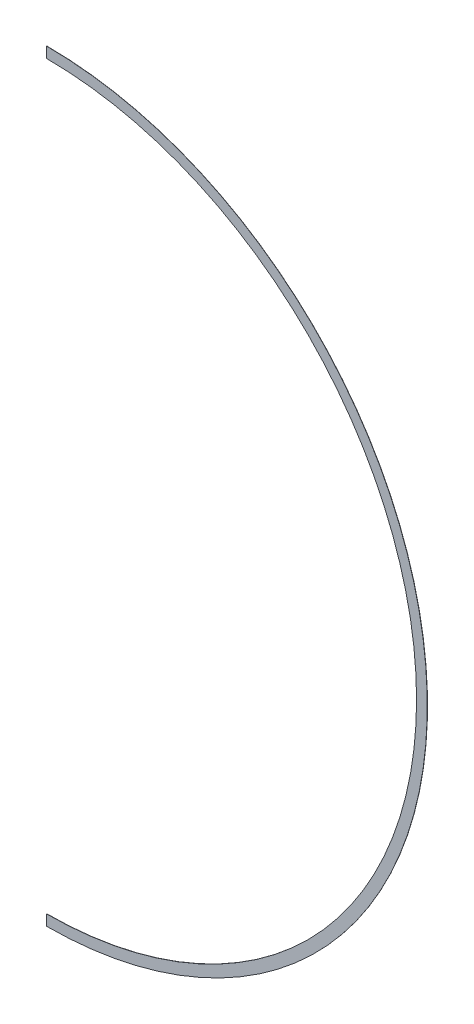
ISO-10303-21;
HEADER;
FILE_DESCRIPTION(('STEP AP214'),'2;1');
FILE_NAME('part.step','',(''),(''),'','','');
FILE_SCHEMA(('AUTOMOTIVE_DESIGN { 1 0 10303 214 1 1 1 1 }'));
ENDSEC;
DATA;
#1=APPLICATION_CONTEXT('core data for automotive mechanical design processes');
#2=APPLICATION_PROTOCOL_DEFINITION('international standard','automotive_design',2000,#1);
#3=PRODUCT_CONTEXT('',#1,'mechanical');
#4=PRODUCT('Part','Part','',(#3));
#5=PRODUCT_RELATED_PRODUCT_CATEGORY('part','',(#4));
#6=PRODUCT_DEFINITION_FORMATION('','',#4);
#7=PRODUCT_DEFINITION_CONTEXT('part definition',#1,'design');
#8=PRODUCT_DEFINITION('design','',#6,#7);
#9=PRODUCT_DEFINITION_SHAPE('','',#8);
#10=(LENGTH_UNIT() NAMED_UNIT(*) SI_UNIT(.MILLI.,.METRE.));
#11=(NAMED_UNIT(*) PLANE_ANGLE_UNIT() SI_UNIT($,.RADIAN.));
#12=(NAMED_UNIT(*) SI_UNIT($,.STERADIAN.) SOLID_ANGLE_UNIT());
#13=UNCERTAINTY_MEASURE_WITH_UNIT(LENGTH_MEASURE(1.E-05),#10,'distance_accuracy_value','');
#14=(GEOMETRIC_REPRESENTATION_CONTEXT(3) GLOBAL_UNCERTAINTY_ASSIGNED_CONTEXT((#13)) GLOBAL_UNIT_ASSIGNED_CONTEXT((#10,
#11,#12)) REPRESENTATION_CONTEXT('',''));
#15=CARTESIAN_POINT('',(0.,0.,0.));
#16=DIRECTION('',(0.,0.,1.));
#17=DIRECTION('',(1.,0.,0.));
#18=AXIS2_PLACEMENT_3D('',#15,#16,#17);
#19=CARTESIAN_POINT('',(0.,0.,0.127));
#20=DIRECTION('',(0.,0.,-1.));
#21=DIRECTION('',(-1.,0.,0.));
#22=AXIS2_PLACEMENT_3D('',#19,#20,#21);
#23=CYLINDRICAL_SURFACE('',#22,207.);
#24=CARTESIAN_POINT('',(0.,0.,0.));
#25=DIRECTION('',(0.,0.,-1.));
#26=DIRECTION('',(-1.,0.,0.));
#27=AXIS2_PLACEMENT_3D('',#24,#25,#26);
#28=CIRCLE('',#27,207.);
#29=CARTESIAN_POINT('',(0.249999999999988,206.999849033761,0.));
#30=VERTEX_POINT('',#29);
#31=CARTESIAN_POINT('',(0.250000000000038,-206.999849033761,0.));
#32=VERTEX_POINT('',#31);
#33=EDGE_CURVE('E98',#30,#32,#28,.T.);
#34=ORIENTED_EDGE('',*,*,#33,.T.);
#35=DIRECTION('',(0.,0.,-1.));
#36=VECTOR('',#35,1.);
#37=CARTESIAN_POINT('',(0.250000000000038,-206.999849033761,0.127));
#38=LINE('',#37,#36);
#39=CARTESIAN_POINT('',(0.250000000000038,-206.999849033761,0.127));
#40=VERTEX_POINT('',#39);
#41=EDGE_CURVE('E56',#32,#40,#38,.F.);
#42=ORIENTED_EDGE('',*,*,#41,.T.);
#43=CARTESIAN_POINT('',(0.,0.,0.127));
#44=DIRECTION('',(0.,0.,-1.));
#45=DIRECTION('',(-1.,0.,0.));
#46=AXIS2_PLACEMENT_3D('',#43,#44,#45);
#47=CIRCLE('',#46,207.);
#48=CARTESIAN_POINT('',(0.249999999999988,206.999849033761,0.127));
#49=VERTEX_POINT('',#48);
#50=EDGE_CURVE('E89',#49,#40,#47,.T.);
#51=ORIENTED_EDGE('',*,*,#50,.F.);
#52=DIRECTION('',(0.,0.,-1.));
#53=VECTOR('',#52,1.);
#54=CARTESIAN_POINT('',(0.249999999999988,206.999849033761,0.127));
#55=LINE('',#54,#53);
#56=EDGE_CURVE('E80',#49,#30,#55,.T.);
#57=ORIENTED_EDGE('',*,*,#56,.T.);
#58=EDGE_LOOP('',(#34,#42,#51,#57));
#59=FACE_BOUND('',#58,.T.);
#60=ADVANCED_FACE('F35',(#59),#23,.F.);
#61=CARTESIAN_POINT('',(0.,0.,0.127));
#62=DIRECTION('',(0.,0.,-1.));
#63=DIRECTION('',(-1.,0.,0.));
#64=AXIS2_PLACEMENT_3D('',#61,#62,#63);
#65=CYLINDRICAL_SURFACE('',#64,213.);
#66=CARTESIAN_POINT('',(0.,0.,0.127));
#67=DIRECTION('',(0.,0.,1.));
#68=DIRECTION('',(-1.,0.,0.));
#69=AXIS2_PLACEMENT_3D('',#66,#67,#68);
#70=CIRCLE('',#69,213.);
#71=CARTESIAN_POINT('',(0.250000000000039,-212.999853286334,0.127));
#72=VERTEX_POINT('',#71);
#73=CARTESIAN_POINT('',(0.249999999999987,212.999853286334,0.127));
#74=VERTEX_POINT('',#73);
#75=EDGE_CURVE('E87',#72,#74,#70,.T.);
#76=ORIENTED_EDGE('',*,*,#75,.F.);
#77=DIRECTION('',(0.,0.,-1.));
#78=VECTOR('',#77,1.);
#79=CARTESIAN_POINT('',(0.250000000000039,-212.999853286334,0.127));
#80=LINE('',#79,#78);
#81=CARTESIAN_POINT('',(0.250000000000039,-212.999853286334,0.));
#82=VERTEX_POINT('',#81);
#83=EDGE_CURVE('E72',#72,#82,#80,.T.);
#84=ORIENTED_EDGE('',*,*,#83,.T.);
#85=CARTESIAN_POINT('',(0.,0.,0.));
#86=DIRECTION('',(0.,0.,1.));
#87=DIRECTION('',(-1.,0.,0.));
#88=AXIS2_PLACEMENT_3D('',#85,#86,#87);
#89=CIRCLE('',#88,213.);
#90=CARTESIAN_POINT('',(0.249999999999987,212.999853286334,0.));
#91=VERTEX_POINT('',#90);
#92=EDGE_CURVE('E94',#82,#91,#89,.T.);
#93=ORIENTED_EDGE('',*,*,#92,.T.);
#94=DIRECTION('',(0.,0.,-1.));
#95=VECTOR('',#94,1.);
#96=CARTESIAN_POINT('',(0.249999999999987,212.999853286334,0.127));
#97=LINE('',#96,#95);
#98=EDGE_CURVE('E48',#91,#74,#97,.F.);
#99=ORIENTED_EDGE('',*,*,#98,.T.);
#100=EDGE_LOOP('',(#76,#84,#93,#99));
#101=FACE_BOUND('',#100,.T.);
#102=ADVANCED_FACE('F92',(#101),#65,.T.);
#103=CARTESIAN_POINT('',(0.,0.,0.127));
#104=DIRECTION('',(0.,0.,-1.));
#105=DIRECTION('',(-1.,0.,0.));
#106=AXIS2_PLACEMENT_3D('',#103,#104,#105);
#107=PLANE('',#106);
#108=ORIENTED_EDGE('',*,*,#75,.T.);
#109=DIRECTION('',(0.,1.,0.));
#110=VECTOR('',#109,1.);
#111=CARTESIAN_POINT('',(0.249999999999987,213.,0.127));
#112=LINE('',#111,#110);
#113=EDGE_CURVE('E90',#49,#74,#112,.T.);
#114=ORIENTED_EDGE('',*,*,#113,.F.);
#115=ORIENTED_EDGE('',*,*,#50,.T.);
#116=EDGE_CURVE('E75',#72,#40,#112,.T.);
#117=ORIENTED_EDGE('',*,*,#116,.F.);
#118=EDGE_LOOP('',(#108,#114,#115,#117));
#119=FACE_BOUND('',#118,.T.);
#120=ADVANCED_FACE('F85',(#119),#107,.F.);
#121=CARTESIAN_POINT('',(0.,0.,0.));
#122=DIRECTION('',(0.,0.,-1.));
#123=DIRECTION('',(-1.,0.,0.));
#124=AXIS2_PLACEMENT_3D('',#121,#122,#123);
#125=PLANE('',#124);
#126=DIRECTION('',(0.,-1.,0.));
#127=VECTOR('',#126,1.);
#128=CARTESIAN_POINT('',(0.250000000000013,0.,0.));
#129=LINE('',#128,#127);
#130=EDGE_CURVE('E11',#91,#30,#129,.T.);
#131=ORIENTED_EDGE('',*,*,#130,.F.);
#132=ORIENTED_EDGE('',*,*,#92,.F.);
#133=EDGE_CURVE('E38',#32,#82,#129,.T.);
#134=ORIENTED_EDGE('',*,*,#133,.F.);
#135=ORIENTED_EDGE('',*,*,#33,.F.);
#136=EDGE_LOOP('',(#131,#132,#134,#135));
#137=FACE_BOUND('',#136,.T.);
#138=ADVANCED_FACE('F101',(#137),#125,.T.);
#139=CARTESIAN_POINT('',(0.249999999999987,213.,0.));
#140=DIRECTION('',(1.,0.,0.));
#141=DIRECTION('',(0.,1.,0.));
#142=AXIS2_PLACEMENT_3D('',#139,#140,#141);
#143=PLANE('',#142);
#144=ORIENTED_EDGE('',*,*,#133,.T.);
#145=ORIENTED_EDGE('',*,*,#83,.F.);
#146=ORIENTED_EDGE('',*,*,#116,.T.);
#147=ORIENTED_EDGE('',*,*,#41,.F.);
#148=EDGE_LOOP('',(#144,#145,#146,#147));
#149=FACE_BOUND('',#148,.T.);
#150=ADVANCED_FACE('F74',(#149),#143,.F.);
#151=ORIENTED_EDGE('',*,*,#113,.T.);
#152=ORIENTED_EDGE('',*,*,#98,.F.);
#153=ORIENTED_EDGE('',*,*,#130,.T.);
#154=ORIENTED_EDGE('',*,*,#56,.F.);
#155=EDGE_LOOP('',(#151,#152,#153,#154));
#156=FACE_BOUND('',#155,.T.);
#157=ADVANCED_FACE('F104',(#156),#143,.F.);
#158=CLOSED_SHELL('',(#60,#102,#120,#138,#150,#157));
#159=MANIFOLD_SOLID_BREP('B2',#158);
#160=ADVANCED_BREP_SHAPE_REPRESENTATION('',(#18,#159),#14);
#161=SHAPE_DEFINITION_REPRESENTATION(#9,#160);
ENDSEC;
END-ISO-10303-21;
